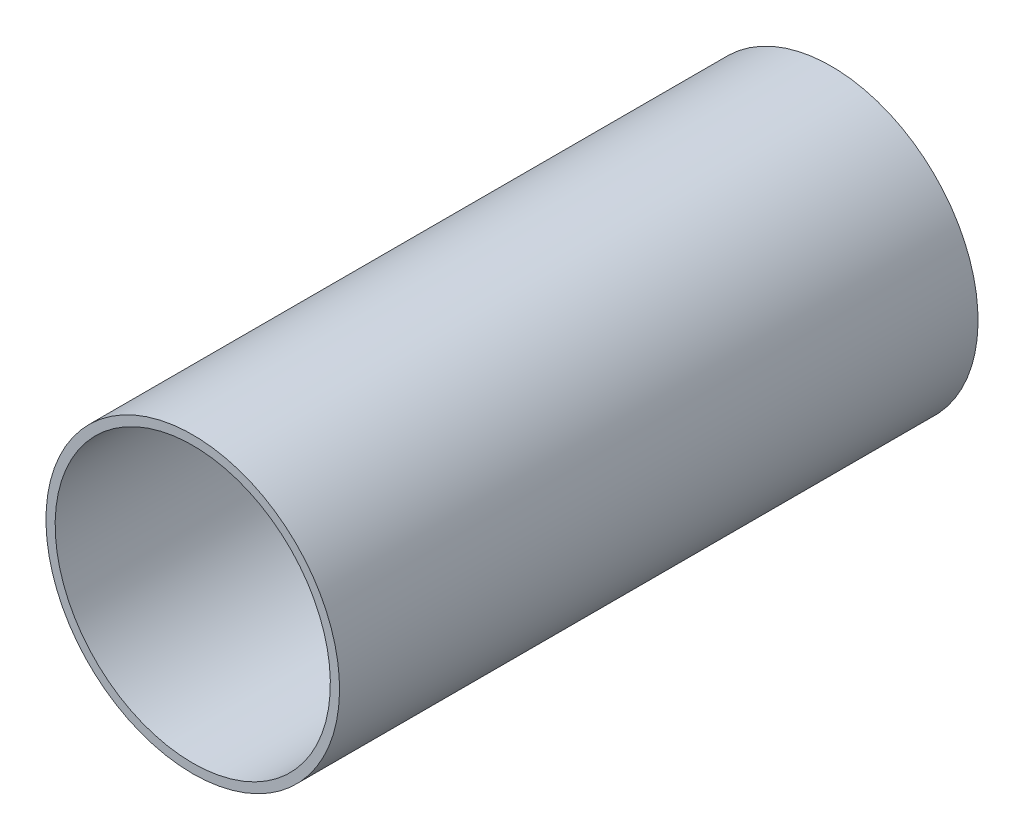
ISO-10303-21;
HEADER;
FILE_DESCRIPTION(('STEP AP214'),'2;1');
FILE_NAME('part.step','',(''),(''),'','','');
FILE_SCHEMA(('AUTOMOTIVE_DESIGN { 1 0 10303 214 1 1 1 1 }'));
ENDSEC;
DATA;
#1=APPLICATION_CONTEXT('core data for automotive mechanical design processes');
#2=APPLICATION_PROTOCOL_DEFINITION('international standard','automotive_design',2000,#1);
#3=PRODUCT_CONTEXT('',#1,'mechanical');
#4=PRODUCT('Part','Part','',(#3));
#5=PRODUCT_RELATED_PRODUCT_CATEGORY('part','',(#4));
#6=PRODUCT_DEFINITION_FORMATION('','',#4);
#7=PRODUCT_DEFINITION_CONTEXT('part definition',#1,'design');
#8=PRODUCT_DEFINITION('design','',#6,#7);
#9=PRODUCT_DEFINITION_SHAPE('','',#8);
#10=(LENGTH_UNIT() NAMED_UNIT(*) SI_UNIT(.MILLI.,.METRE.));
#11=(NAMED_UNIT(*) PLANE_ANGLE_UNIT() SI_UNIT($,.RADIAN.));
#12=(NAMED_UNIT(*) SI_UNIT($,.STERADIAN.) SOLID_ANGLE_UNIT());
#13=UNCERTAINTY_MEASURE_WITH_UNIT(LENGTH_MEASURE(1.E-05),#10,'distance_accuracy_value','');
#14=(GEOMETRIC_REPRESENTATION_CONTEXT(3) GLOBAL_UNCERTAINTY_ASSIGNED_CONTEXT((#13)) GLOBAL_UNIT_ASSIGNED_CONTEXT((#10,
#11,#12)) REPRESENTATION_CONTEXT('',''));
#15=CARTESIAN_POINT('',(0.,0.,0.));
#16=DIRECTION('',(0.,0.,1.));
#17=DIRECTION('',(1.,0.,0.));
#18=AXIS2_PLACEMENT_3D('',#15,#16,#17);
#19=CARTESIAN_POINT('',(147.32,-80.772,-0.045));
#20=DIRECTION('',(0.,0.,-1.));
#21=DIRECTION('',(0.,-1.,0.));
#22=AXIS2_PLACEMENT_3D('',#19,#20,#21);
#23=CYLINDRICAL_SURFACE('',#22,0.375);
#24=CARTESIAN_POINT('',(147.32,-80.772,-0.035));
#25=DIRECTION('',(0.,0.,-1.));
#26=DIRECTION('',(0.,-1.,0.));
#27=AXIS2_PLACEMENT_3D('',#24,#25,#26);
#28=CIRCLE('',#27,0.375);
#29=CARTESIAN_POINT('',(147.32,-81.147,-0.035));
#30=VERTEX_POINT('',#29);
#31=EDGE_CURVE('E64',#30,#30,#28,.T.);
#32=ORIENTED_EDGE('',*,*,#31,.T.);
#33=DIRECTION('',(0.,0.,1.));
#34=VECTOR('',#33,1.);
#35=CARTESIAN_POINT('',(147.32,-81.147,-0.045));
#36=LINE('',#35,#34);
#37=CARTESIAN_POINT('',(147.32,-81.147,1.705));
#38=VERTEX_POINT('',#37);
#39=EDGE_CURVE('E11',#30,#38,#36,.T.);
#40=ORIENTED_EDGE('',*,*,#39,.T.);
#41=CARTESIAN_POINT('',(147.32,-80.772,1.705));
#42=DIRECTION('',(0.,0.,-1.));
#43=DIRECTION('',(0.,-1.,0.));
#44=AXIS2_PLACEMENT_3D('',#41,#42,#43);
#45=CIRCLE('',#44,0.375);
#46=EDGE_CURVE('E25',#38,#38,#45,.T.);
#47=ORIENTED_EDGE('',*,*,#46,.F.);
#48=ORIENTED_EDGE('',*,*,#39,.F.);
#49=EDGE_LOOP('',(#32,#40,#47,#48));
#50=FACE_BOUND('',#49,.T.);
#51=ADVANCED_FACE('F17',(#50),#23,.F.);
#52=CARTESIAN_POINT('',(147.32,-81.172,1.705));
#53=DIRECTION('',(0.,0.,1.));
#54=DIRECTION('',(1.,0.,0.));
#55=AXIS2_PLACEMENT_3D('',#52,#53,#54);
#56=PLANE('',#55);
#57=ORIENTED_EDGE('',*,*,#46,.T.);
#58=EDGE_LOOP('',(#57));
#59=FACE_BOUND('',#58,.T.);
#60=CARTESIAN_POINT('',(147.32,-80.772,1.705));
#61=DIRECTION('',(0.,0.,1.));
#62=DIRECTION('',(0.,-1.,0.));
#63=AXIS2_PLACEMENT_3D('',#60,#61,#62);
#64=CIRCLE('',#63,0.4);
#65=CARTESIAN_POINT('',(147.32,-81.172,1.705));
#66=VERTEX_POINT('',#65);
#67=EDGE_CURVE('E56',#66,#66,#64,.T.);
#68=ORIENTED_EDGE('',*,*,#67,.T.);
#69=EDGE_LOOP('',(#68));
#70=FACE_BOUND('',#69,.T.);
#71=ADVANCED_FACE('F73',(#59,#70),#56,.T.);
#72=CARTESIAN_POINT('',(147.32,-81.172,-0.035));
#73=DIRECTION('',(0.,0.,1.));
#74=DIRECTION('',(1.,0.,0.));
#75=AXIS2_PLACEMENT_3D('',#72,#73,#74);
#76=PLANE('',#75);
#77=ORIENTED_EDGE('',*,*,#31,.F.);
#78=EDGE_LOOP('',(#77));
#79=FACE_BOUND('',#78,.T.);
#80=CARTESIAN_POINT('',(147.32,-80.772,-0.035));
#81=DIRECTION('',(0.,0.,1.));
#82=DIRECTION('',(0.,-1.,0.));
#83=AXIS2_PLACEMENT_3D('',#80,#81,#82);
#84=CIRCLE('',#83,0.4);
#85=CARTESIAN_POINT('',(147.32,-81.172,-0.035));
#86=VERTEX_POINT('',#85);
#87=EDGE_CURVE('E55',#86,#86,#84,.T.);
#88=ORIENTED_EDGE('',*,*,#87,.F.);
#89=EDGE_LOOP('',(#88));
#90=FACE_BOUND('',#89,.T.);
#91=ADVANCED_FACE('F82',(#79,#90),#76,.F.);
#92=CARTESIAN_POINT('',(147.32,-80.772,-0.035));
#93=DIRECTION('',(0.,0.,-1.));
#94=DIRECTION('',(0.,-1.,0.));
#95=AXIS2_PLACEMENT_3D('',#92,#93,#94);
#96=CYLINDRICAL_SURFACE('',#95,0.4);
#97=ORIENTED_EDGE('',*,*,#87,.T.);
#98=DIRECTION('',(0.,0.,1.));
#99=VECTOR('',#98,1.);
#100=CARTESIAN_POINT('',(147.32,-81.172,-0.035));
#101=LINE('',#100,#99);
#102=EDGE_CURVE('E52',#86,#66,#101,.T.);
#103=ORIENTED_EDGE('',*,*,#102,.T.);
#104=ORIENTED_EDGE('',*,*,#67,.F.);
#105=ORIENTED_EDGE('',*,*,#102,.F.);
#106=EDGE_LOOP('',(#97,#103,#104,#105));
#107=FACE_BOUND('',#106,.T.);
#108=ADVANCED_FACE('F53',(#107),#96,.T.);
#109=CLOSED_SHELL('',(#51,#71,#91,#108));
#110=MANIFOLD_SOLID_BREP('B1',#109);
#111=ADVANCED_BREP_SHAPE_REPRESENTATION('',(#18,#110),#14);
#112=SHAPE_DEFINITION_REPRESENTATION(#9,#111);
ENDSEC;
END-ISO-10303-21;
